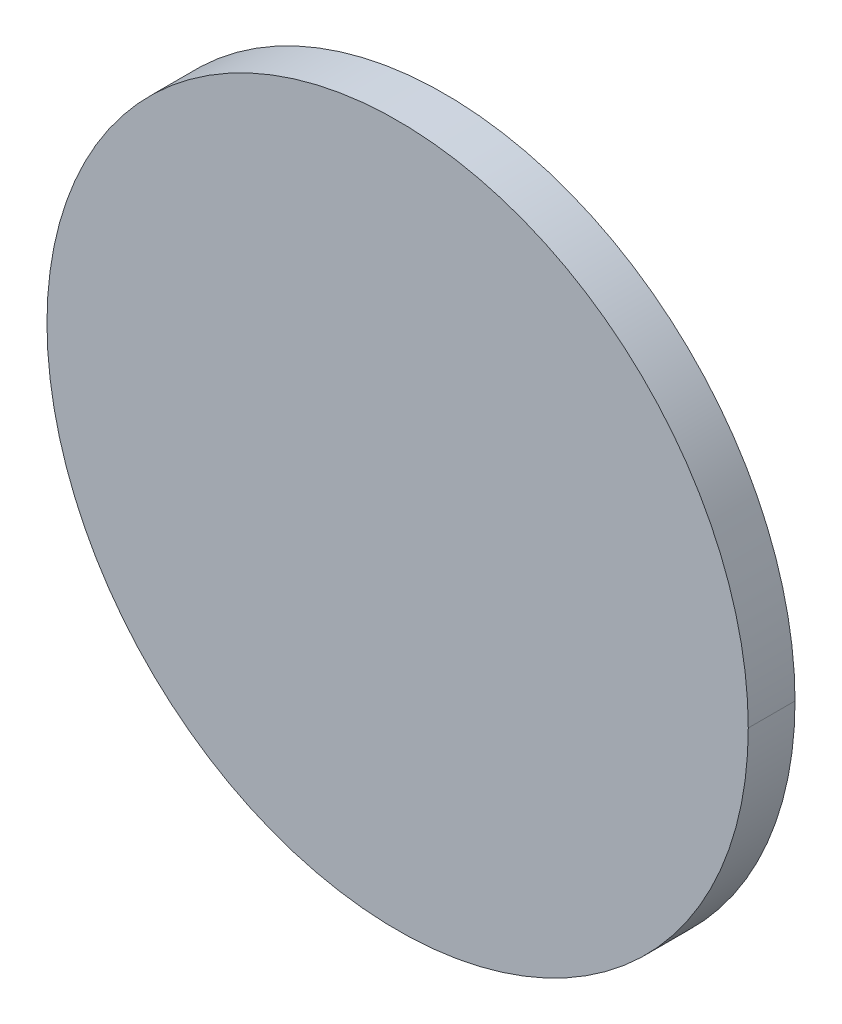
ISO-10303-21;
HEADER;
FILE_DESCRIPTION(('STEP AP214'),'2;1');
FILE_NAME('part.step','',(''),(''),'','','');
FILE_SCHEMA(('AUTOMOTIVE_DESIGN { 1 0 10303 214 1 1 1 1 }'));
ENDSEC;
DATA;
#1=APPLICATION_CONTEXT('core data for automotive mechanical design processes');
#2=APPLICATION_PROTOCOL_DEFINITION('international standard','automotive_design',2000,#1);
#3=PRODUCT_CONTEXT('',#1,'mechanical');
#4=PRODUCT('Part','Part','',(#3));
#5=PRODUCT_RELATED_PRODUCT_CATEGORY('part','',(#4));
#6=PRODUCT_DEFINITION_FORMATION('','',#4);
#7=PRODUCT_DEFINITION_CONTEXT('part definition',#1,'design');
#8=PRODUCT_DEFINITION('design','',#6,#7);
#9=PRODUCT_DEFINITION_SHAPE('','',#8);
#10=(LENGTH_UNIT() NAMED_UNIT(*) SI_UNIT(.MILLI.,.METRE.));
#11=(NAMED_UNIT(*) PLANE_ANGLE_UNIT() SI_UNIT($,.RADIAN.));
#12=(NAMED_UNIT(*) SI_UNIT($,.STERADIAN.) SOLID_ANGLE_UNIT());
#13=UNCERTAINTY_MEASURE_WITH_UNIT(LENGTH_MEASURE(1.E-05),#10,'distance_accuracy_value','');
#14=(GEOMETRIC_REPRESENTATION_CONTEXT(3) GLOBAL_UNCERTAINTY_ASSIGNED_CONTEXT((#13)) GLOBAL_UNIT_ASSIGNED_CONTEXT((#10,
#11,#12)) REPRESENTATION_CONTEXT('',''));
#15=CARTESIAN_POINT('',(0.,0.,0.));
#16=DIRECTION('',(0.,0.,1.));
#17=DIRECTION('',(1.,0.,0.));
#18=AXIS2_PLACEMENT_3D('',#15,#16,#17);
#19=CARTESIAN_POINT('',(-1.3,1.25,2.05));
#20=DIRECTION('',(0.,0.,1.));
#21=DIRECTION('',(1.,0.,0.));
#22=AXIS2_PLACEMENT_3D('',#19,#20,#21);
#23=PLANE('',#22);
#24=CARTESIAN_POINT('',(-1.3,1.25,2.05));
#25=DIRECTION('',(0.,0.,-1.));
#26=DIRECTION('',(-1.,0.,0.));
#27=AXIS2_PLACEMENT_3D('',#24,#25,#26);
#28=CIRCLE('',#27,0.375);
#29=CARTESIAN_POINT('',(-1.675,1.25,2.05));
#30=VERTEX_POINT('',#29);
#31=CARTESIAN_POINT('',(-0.925,1.25,2.05));
#32=VERTEX_POINT('',#31);
#33=EDGE_CURVE('E63',#30,#32,#28,.T.);
#34=ORIENTED_EDGE('',*,*,#33,.F.);
#35=CARTESIAN_POINT('',(-1.3,1.25,2.05));
#36=DIRECTION('',(0.,0.,-1.));
#37=DIRECTION('',(-1.,0.,0.));
#38=AXIS2_PLACEMENT_3D('',#35,#36,#37);
#39=CIRCLE('',#38,0.375);
#40=EDGE_CURVE('E11',#32,#30,#39,.T.);
#41=ORIENTED_EDGE('',*,*,#40,.F.);
#42=EDGE_LOOP('',(#34,#41));
#43=FACE_BOUND('',#42,.T.);
#44=ADVANCED_FACE('F17',(#43),#23,.T.);
#45=CARTESIAN_POINT('',(-1.3,1.25,2.05));
#46=DIRECTION('',(0.,0.,-1.));
#47=DIRECTION('',(-1.,0.,0.));
#48=AXIS2_PLACEMENT_3D('',#45,#46,#47);
#49=CYLINDRICAL_SURFACE('',#48,0.375);
#50=DIRECTION('',(0.,0.,-1.));
#51=VECTOR('',#50,1.);
#52=CARTESIAN_POINT('',(-0.925,1.25,2.05));
#53=LINE('',#52,#51);
#54=CARTESIAN_POINT('',(-0.925,1.25,2.));
#55=VERTEX_POINT('',#54);
#56=EDGE_CURVE('E57',#32,#55,#53,.T.);
#57=ORIENTED_EDGE('',*,*,#56,.F.);
#58=ORIENTED_EDGE('',*,*,#40,.T.);
#59=DIRECTION('',(0.,0.,-1.));
#60=VECTOR('',#59,1.);
#61=CARTESIAN_POINT('',(-1.675,1.25,2.05));
#62=LINE('',#61,#60);
#63=CARTESIAN_POINT('',(-1.675,1.25,2.));
#64=VERTEX_POINT('',#63);
#65=EDGE_CURVE('E54',#30,#64,#62,.T.);
#66=ORIENTED_EDGE('',*,*,#65,.T.);
#67=CARTESIAN_POINT('',(-1.3,1.25,2.));
#68=DIRECTION('',(0.,0.,1.));
#69=DIRECTION('',(-1.,0.,0.));
#70=AXIS2_PLACEMENT_3D('',#67,#68,#69);
#71=CIRCLE('',#70,0.375);
#72=EDGE_CURVE('E25',#64,#55,#71,.T.);
#73=ORIENTED_EDGE('',*,*,#72,.T.);
#74=EDGE_LOOP('',(#57,#58,#66,#73));
#75=FACE_BOUND('',#74,.T.);
#76=ADVANCED_FACE('F53',(#75),#49,.T.);
#77=CARTESIAN_POINT('',(-1.3,1.25,2.));
#78=DIRECTION('',(0.,0.,1.));
#79=DIRECTION('',(1.,0.,0.));
#80=AXIS2_PLACEMENT_3D('',#77,#78,#79);
#81=PLANE('',#80);
#82=ORIENTED_EDGE('',*,*,#72,.F.);
#83=CARTESIAN_POINT('',(-1.3,1.25,2.));
#84=DIRECTION('',(0.,0.,1.));
#85=DIRECTION('',(-1.,0.,0.));
#86=AXIS2_PLACEMENT_3D('',#83,#84,#85);
#87=CIRCLE('',#86,0.375);
#88=EDGE_CURVE('E64',#55,#64,#87,.T.);
#89=ORIENTED_EDGE('',*,*,#88,.F.);
#90=EDGE_LOOP('',(#82,#89));
#91=FACE_BOUND('',#90,.T.);
#92=ADVANCED_FACE('F118',(#91),#81,.F.);
#93=CARTESIAN_POINT('',(-1.3,1.25,2.05));
#94=DIRECTION('',(0.,0.,-1.));
#95=DIRECTION('',(-1.,0.,0.));
#96=AXIS2_PLACEMENT_3D('',#93,#94,#95);
#97=CYLINDRICAL_SURFACE('',#96,0.375);
#98=ORIENTED_EDGE('',*,*,#33,.T.);
#99=ORIENTED_EDGE('',*,*,#56,.T.);
#100=ORIENTED_EDGE('',*,*,#88,.T.);
#101=ORIENTED_EDGE('',*,*,#65,.F.);
#102=EDGE_LOOP('',(#98,#99,#100,#101));
#103=FACE_BOUND('',#102,.T.);
#104=ADVANCED_FACE('F62',(#103),#97,.T.);
#105=CLOSED_SHELL('',(#44,#76,#92,#104));
#106=MANIFOLD_SOLID_BREP('B1',#105);
#107=ADVANCED_BREP_SHAPE_REPRESENTATION('',(#18,#106),#14);
#108=SHAPE_DEFINITION_REPRESENTATION(#9,#107);
ENDSEC;
END-ISO-10303-21;
